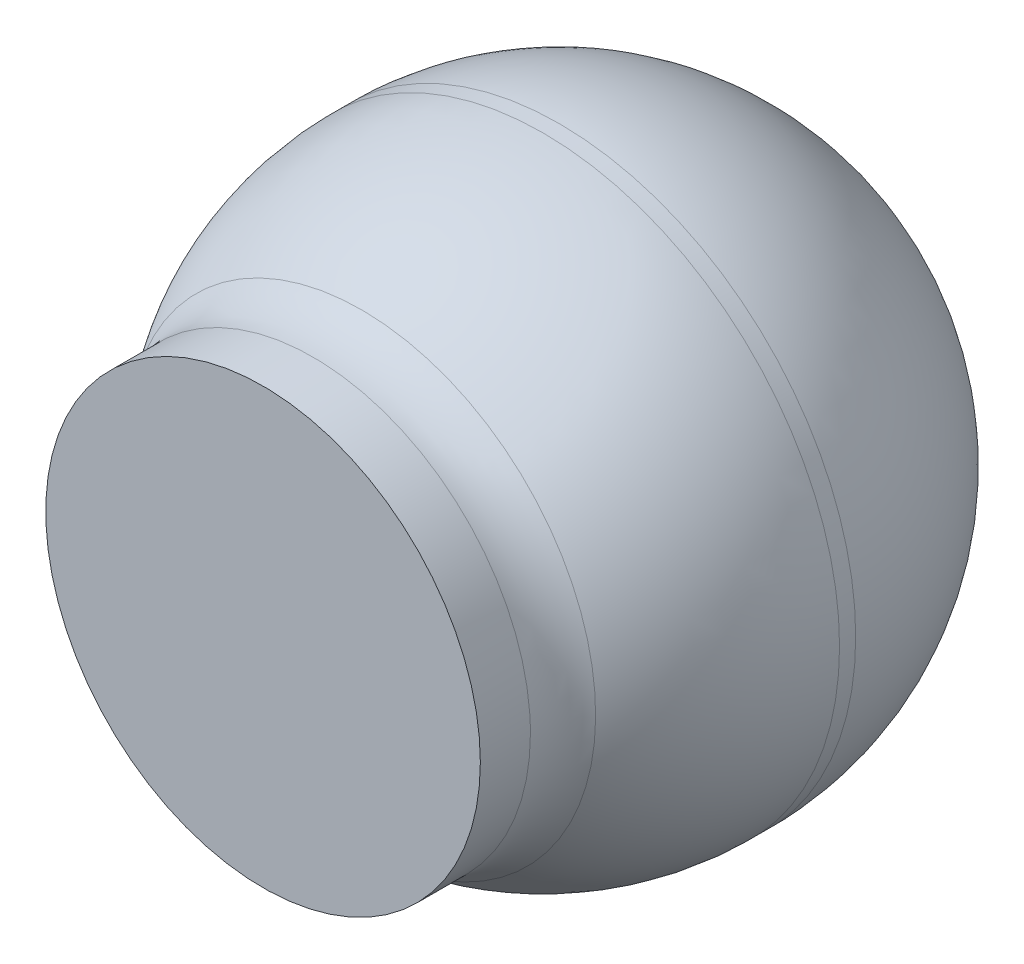
ISO-10303-21;
HEADER;
FILE_DESCRIPTION(('STEP AP214'),'2;1');
FILE_NAME('part.step','',(''),(''),'','','');
FILE_SCHEMA(('AUTOMOTIVE_DESIGN { 1 0 10303 214 1 1 1 1 }'));
ENDSEC;
DATA;
#1=APPLICATION_CONTEXT('core data for automotive mechanical design processes');
#2=APPLICATION_PROTOCOL_DEFINITION('international standard','automotive_design',2000,#1);
#3=PRODUCT_CONTEXT('',#1,'mechanical');
#4=PRODUCT('Part','Part','',(#3));
#5=PRODUCT_RELATED_PRODUCT_CATEGORY('part','',(#4));
#6=PRODUCT_DEFINITION_FORMATION('','',#4);
#7=PRODUCT_DEFINITION_CONTEXT('part definition',#1,'design');
#8=PRODUCT_DEFINITION('design','',#6,#7);
#9=PRODUCT_DEFINITION_SHAPE('','',#8);
#10=(LENGTH_UNIT() NAMED_UNIT(*) SI_UNIT(.MILLI.,.METRE.));
#11=(NAMED_UNIT(*) PLANE_ANGLE_UNIT() SI_UNIT($,.RADIAN.));
#12=(NAMED_UNIT(*) SI_UNIT($,.STERADIAN.) SOLID_ANGLE_UNIT());
#13=UNCERTAINTY_MEASURE_WITH_UNIT(LENGTH_MEASURE(1.E-05),#10,'distance_accuracy_value','');
#14=(GEOMETRIC_REPRESENTATION_CONTEXT(3) GLOBAL_UNCERTAINTY_ASSIGNED_CONTEXT((#13)) GLOBAL_UNIT_ASSIGNED_CONTEXT((#10,
#11,#12)) REPRESENTATION_CONTEXT('',''));
#15=CARTESIAN_POINT('',(0.,0.,0.));
#16=DIRECTION('',(0.,0.,1.));
#17=DIRECTION('',(1.,0.,0.));
#18=AXIS2_PLACEMENT_3D('',#15,#16,#17);
#19=CARTESIAN_POINT('',(-6.912919922269,-6.591349291452,10.006534503384));
#20=DIRECTION('',(0.,0.,-1.));
#21=DIRECTION('',(-1.,0.,0.));
#22=AXIS2_PLACEMENT_3D('',#19,#20,#21);
#23=PLANE('',#22);
#24=CARTESIAN_POINT('',(-6.912919922269,-6.591349291452,10.006534503384));
#25=DIRECTION('',(0.,0.,1.));
#26=DIRECTION('',(1.,0.,0.));
#27=AXIS2_PLACEMENT_3D('',#24,#25,#26);
#28=CIRCLE('',#27,0.275);
#29=CARTESIAN_POINT('',(-6.637919922269,-6.591349291452,10.006534503384));
#30=VERTEX_POINT('',#29);
#31=EDGE_CURVE('E20',#30,#30,#28,.F.);
#32=ORIENTED_EDGE('',*,*,#31,.F.);
#33=EDGE_LOOP('',(#32));
#34=FACE_BOUND('',#33,.T.);
#35=ADVANCED_FACE('F17',(#34),#23,.F.);
#36=CARTESIAN_POINT('',(-6.912919922269,-6.591349291452,9.906534503384));
#37=DIRECTION('',(0.,0.,1.));
#38=DIRECTION('',(1.,0.,0.));
#39=AXIS2_PLACEMENT_3D('',#36,#37,#38);
#40=CYLINDRICAL_SURFACE('',#39,0.275);
#41=CARTESIAN_POINT('',(-6.912919922269,-6.591349291452,9.943180457728));
#42=DIRECTION('',(0.,0.,-1.));
#43=DIRECTION('',(0.996700902337583,0.0811622527992439,0.));
#44=AXIS2_PLACEMENT_3D('',#41,#42,#43);
#45=CIRCLE('',#44,0.275);
#46=CARTESIAN_POINT('',(-6.63882717412617,-6.56902967193221,9.943180457728));
#47=VERTEX_POINT('',#46);
#48=EDGE_CURVE('E65',#47,#47,#45,.F.);
#49=ORIENTED_EDGE('',*,*,#48,.T.);
#50=EDGE_LOOP('',(#49));
#51=FACE_BOUND('',#50,.T.);
#52=ORIENTED_EDGE('',*,*,#31,.T.);
#53=EDGE_LOOP('',(#52));
#54=FACE_BOUND('',#53,.T.);
#55=ADVANCED_FACE('F62',(#51,#54),#40,.T.);
#56=CARTESIAN_POINT('',(-6.912919922269,-6.591349291452,9.943180457728));
#57=DIRECTION('',(0.,0.,-1.));
#58=DIRECTION('',(0.996700902337583,0.0811622527992448,0.));
#59=AXIS2_PLACEMENT_3D('',#56,#57,#58);
#60=TOROIDAL_SURFACE('',#59,0.375,0.1);
#61=ORIENTED_EDGE('',*,*,#48,.F.);
#62=EDGE_LOOP('',(#61));
#63=FACE_BOUND('',#62,.T.);
#64=CARTESIAN_POINT('',(-6.912919922269,-6.591349291452,9.881744931236));
#65=DIRECTION('',(0.,0.,-1.));
#66=DIRECTION('',(-0.996700902337598,-0.0811622527990593,0.));
#67=AXIS2_PLACEMENT_3D('',#64,#65,#66);
#68=CIRCLE('',#67,0.296097046412665);
#69=CARTESIAN_POINT('',(-7.208040115608,-6.615381194786,9.881744931236));
#70=VERTEX_POINT('',#69);
#71=EDGE_CURVE('E39',#70,#70,#68,.T.);
#72=ORIENTED_EDGE('',*,*,#71,.F.);
#73=EDGE_LOOP('',(#72));
#74=FACE_BOUND('',#73,.T.);
#75=ADVANCED_FACE('F57',(#63,#74),#60,.F.);
#76=CARTESIAN_POINT('',(-7.286682760645,-6.621785136252,9.651976062157));
#77=CARTESIAN_POINT('',(-7.286682760645,-6.621785136252,9.701461392103));
#78=CARTESIAN_POINT('',(-7.278526217348,-6.621120941579,9.750947004335));
#79=CARTESIAN_POINT('',(-7.262207085349,-6.619792059952,9.798626332798));
#80=CARTESIAN_POINT('',(-7.238341390838,-6.617848654938,9.842699544317));
#81=CARTESIAN_POINT('',(-7.208040115608,-6.615381194786,9.881744931236));
#82=(BOUNDED_CURVE() B_SPLINE_CURVE(5,(#76,#77,#78,#79,#80,#81),.UNSPECIFIED.,.F.,
.F.) B_SPLINE_CURVE_WITH_KNOTS((6,6),(0.,0.661568582165),
.UNSPECIFIED.) CURVE() GEOMETRIC_REPRESENTATION_ITEM() RATIONAL_B_SPLINE_CURVE((1.,1.,1.,1.,1.,1.)) REPRESENTATION_ITEM(''));
#83=CARTESIAN_POINT('',(-6.912919922269,-6.591349291452,9.651976062157));
#84=DIRECTION('',(0.,0.,-1.));
#85=AXIS1_PLACEMENT('',#83,#84);
#86=SURFACE_OF_REVOLUTION('',#82,#85);
#87=CARTESIAN_POINT('',(-6.912919922269,-6.591349291452,9.651976062157));
#88=DIRECTION('',(0.,0.,1.));
#89=DIRECTION('',(1.,0.,0.));
#90=AXIS2_PLACEMENT_3D('',#87,#88,#89);
#91=CIRCLE('',#90,0.375);
#92=CARTESIAN_POINT('',(-6.537919922269,-6.591349291452,9.651976062157));
#93=VERTEX_POINT('',#92);
#94=EDGE_CURVE('E36',#93,#93,#91,.F.);
#95=ORIENTED_EDGE('',*,*,#94,.F.);
#96=EDGE_LOOP('',(#95));
#97=FACE_BOUND('',#96,.T.);
#98=ORIENTED_EDGE('',*,*,#71,.T.);
#99=EDGE_LOOP('',(#98));
#100=FACE_BOUND('',#99,.T.);
#101=ADVANCED_FACE('F53',(#97,#100),#86,.F.);
#102=CARTESIAN_POINT('',(-6.912919922269,-6.591349291452,9.256534503384));
#103=DIRECTION('',(0.,0.,1.));
#104=DIRECTION('',(1.,0.,0.));
#105=AXIS2_PLACEMENT_3D('',#102,#103,#104);
#106=CYLINDRICAL_SURFACE('',#105,0.375);
#107=CARTESIAN_POINT('',(-6.912919922269,-6.591349291452,9.631534503384));
#108=DIRECTION('',(0.,0.,-1.));
#109=DIRECTION('',(0.0811622527992357,-0.996700902337583,0.));
#110=AXIS2_PLACEMENT_3D('',#107,#108,#109);
#111=CIRCLE('',#110,0.375);
#112=CARTESIAN_POINT('',(-6.88248407746929,-6.96511212982859,9.631534503384));
#113=VERTEX_POINT('',#112);
#114=CARTESIAN_POINT('',(-6.94335576706871,-6.21758645307541,9.631534503384));
#115=VERTEX_POINT('',#114);
#116=EDGE_CURVE('E11',#113,#115,#111,.T.);
#117=ORIENTED_EDGE('',*,*,#116,.F.);
#118=CARTESIAN_POINT('',(-6.912919922269,-6.591349291452,9.631534503384));
#119=DIRECTION('',(0.,0.,1.));
#120=DIRECTION('',(0.0811622527992365,-0.996700902337583,0.));
#121=AXIS2_PLACEMENT_3D('',#118,#119,#120);
#122=CIRCLE('',#121,0.375);
#123=EDGE_CURVE('E25',#115,#113,#122,.F.);
#124=ORIENTED_EDGE('',*,*,#123,.F.);
#125=EDGE_LOOP('',(#117,#124));
#126=FACE_BOUND('',#125,.T.);
#127=ORIENTED_EDGE('',*,*,#94,.T.);
#128=EDGE_LOOP('',(#127));
#129=FACE_BOUND('',#128,.T.);
#130=ADVANCED_FACE('F34',(#126,#129),#106,.T.);
#131=CARTESIAN_POINT('',(-6.912919922269,-6.591349291452,9.631534503384));
#132=DIRECTION('',(0.0811622527992361,-0.996700902337583,0.));
#133=DIRECTION('',(-0.996700902337583,-0.0811622527992361,0.));
#134=AXIS2_PLACEMENT_3D('',#131,#132,#133);
#135=SPHERICAL_SURFACE('',#134,0.375);
#136=ORIENTED_EDGE('',*,*,#123,.T.);
#137=ORIENTED_EDGE('',*,*,#116,.T.);
#138=EDGE_LOOP('',(#136,#137));
#139=FACE_BOUND('',#138,.T.);
#140=ADVANCED_FACE('F32',(#139),#135,.T.);
#141=CLOSED_SHELL('',(#35,#55,#75,#101,#130,#140));
#142=MANIFOLD_SOLID_BREP('B1',#141);
#143=ADVANCED_BREP_SHAPE_REPRESENTATION('',(#18,#142),#14);
#144=SHAPE_DEFINITION_REPRESENTATION(#9,#143);
ENDSEC;
END-ISO-10303-21;
